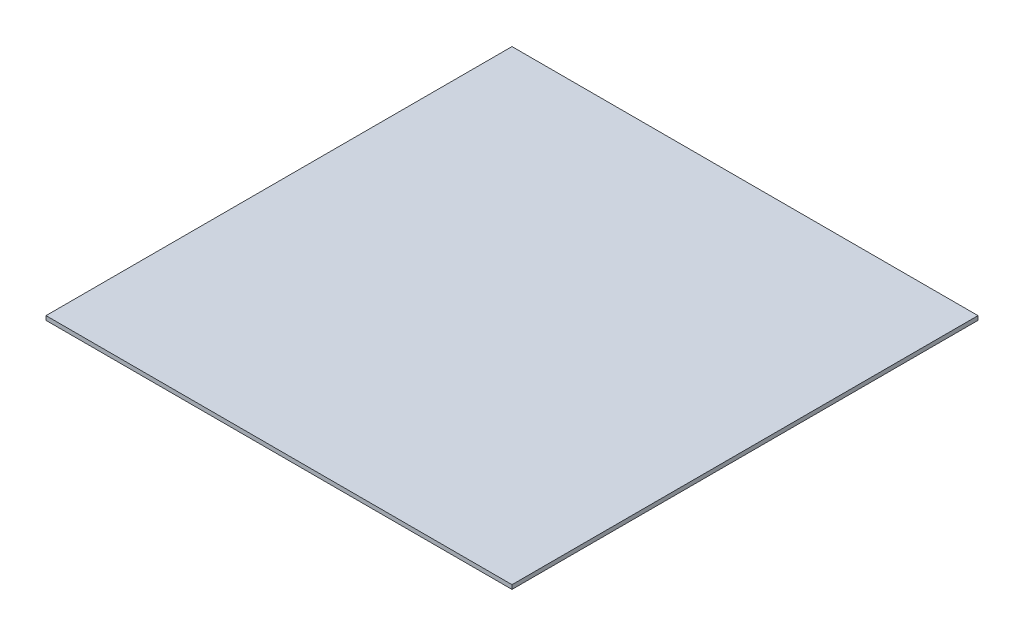
ISO-10303-21;
HEADER;
FILE_DESCRIPTION(('STEP AP214'),'2;1');
FILE_NAME('part.step','',(''),(''),'','','');
FILE_SCHEMA(('AUTOMOTIVE_DESIGN { 1 0 10303 214 1 1 1 1 }'));
ENDSEC;
DATA;
#1=APPLICATION_CONTEXT('core data for automotive mechanical design processes');
#2=APPLICATION_PROTOCOL_DEFINITION('international standard','automotive_design',2000,#1);
#3=PRODUCT_CONTEXT('',#1,'mechanical');
#4=PRODUCT('Part','Part','',(#3));
#5=PRODUCT_RELATED_PRODUCT_CATEGORY('part','',(#4));
#6=PRODUCT_DEFINITION_FORMATION('','',#4);
#7=PRODUCT_DEFINITION_CONTEXT('part definition',#1,'design');
#8=PRODUCT_DEFINITION('design','',#6,#7);
#9=PRODUCT_DEFINITION_SHAPE('','',#8);
#10=(LENGTH_UNIT() NAMED_UNIT(*) SI_UNIT(.MILLI.,.METRE.));
#11=(NAMED_UNIT(*) PLANE_ANGLE_UNIT() SI_UNIT($,.RADIAN.));
#12=(NAMED_UNIT(*) SI_UNIT($,.STERADIAN.) SOLID_ANGLE_UNIT());
#13=UNCERTAINTY_MEASURE_WITH_UNIT(LENGTH_MEASURE(1.E-05),#10,'distance_accuracy_value','');
#14=(GEOMETRIC_REPRESENTATION_CONTEXT(3) GLOBAL_UNCERTAINTY_ASSIGNED_CONTEXT((#13)) GLOBAL_UNIT_ASSIGNED_CONTEXT((#10,
#11,#12)) REPRESENTATION_CONTEXT('',''));
#15=CARTESIAN_POINT('',(0.,0.,0.));
#16=DIRECTION('',(0.,0.,1.));
#17=DIRECTION('',(1.,0.,0.));
#18=AXIS2_PLACEMENT_3D('',#15,#16,#17);
#19=CARTESIAN_POINT('',(112.5,2.,112.5));
#20=DIRECTION('',(-1.,0.,0.));
#21=DIRECTION('',(0.,0.,1.));
#22=AXIS2_PLACEMENT_3D('',#19,#20,#21);
#23=PLANE('',#22);
#24=DIRECTION('',(0.,0.,-1.));
#25=VECTOR('',#24,1.);
#26=CARTESIAN_POINT('',(112.5,0.,112.5));
#27=LINE('',#26,#25);
#28=CARTESIAN_POINT('',(112.5,0.,112.5));
#29=VERTEX_POINT('',#28);
#30=CARTESIAN_POINT('',(112.5,0.,-112.5));
#31=VERTEX_POINT('',#30);
#32=EDGE_CURVE('E100',#29,#31,#27,.T.);
#33=ORIENTED_EDGE('',*,*,#32,.T.);
#34=DIRECTION('',(0.,-1.,0.));
#35=VECTOR('',#34,1.);
#36=CARTESIAN_POINT('',(112.5,2.,-112.5));
#37=LINE('',#36,#35);
#38=CARTESIAN_POINT('',(112.5,2.,-112.5));
#39=VERTEX_POINT('',#38);
#40=EDGE_CURVE('E11',#39,#31,#37,.T.);
#41=ORIENTED_EDGE('',*,*,#40,.F.);
#42=DIRECTION('',(0.,0.,-1.));
#43=VECTOR('',#42,1.);
#44=CARTESIAN_POINT('',(112.5,2.,112.5));
#45=LINE('',#44,#43);
#46=CARTESIAN_POINT('',(112.5,2.,112.5));
#47=VERTEX_POINT('',#46);
#48=EDGE_CURVE('E88',#47,#39,#45,.T.);
#49=ORIENTED_EDGE('',*,*,#48,.F.);
#50=DIRECTION('',(0.,-1.,0.));
#51=VECTOR('',#50,1.);
#52=CARTESIAN_POINT('',(112.5,2.,112.5));
#53=LINE('',#52,#51);
#54=EDGE_CURVE('E96',#47,#29,#53,.T.);
#55=ORIENTED_EDGE('',*,*,#54,.T.);
#56=EDGE_LOOP('',(#33,#41,#49,#55));
#57=FACE_BOUND('',#56,.T.);
#58=ADVANCED_FACE('F37',(#57),#23,.F.);
#59=CARTESIAN_POINT('',(-112.5,2.,-112.5));
#60=DIRECTION('',(0.,0.,1.));
#61=DIRECTION('',(1.,0.,0.));
#62=AXIS2_PLACEMENT_3D('',#59,#60,#61);
#63=PLANE('',#62);
#64=DIRECTION('',(-1.,0.,0.));
#65=VECTOR('',#64,1.);
#66=CARTESIAN_POINT('',(-112.5,0.,-112.5));
#67=LINE('',#66,#65);
#68=CARTESIAN_POINT('',(-112.5,0.,-112.5));
#69=VERTEX_POINT('',#68);
#70=EDGE_CURVE('E92',#31,#69,#67,.T.);
#71=ORIENTED_EDGE('',*,*,#70,.T.);
#72=DIRECTION('',(0.,-1.,0.));
#73=VECTOR('',#72,1.);
#74=CARTESIAN_POINT('',(-112.5,2.,-112.5));
#75=LINE('',#74,#73);
#76=CARTESIAN_POINT('',(-112.5,2.,-112.5));
#77=VERTEX_POINT('',#76);
#78=EDGE_CURVE('E45',#77,#69,#75,.T.);
#79=ORIENTED_EDGE('',*,*,#78,.F.);
#80=DIRECTION('',(-1.,0.,0.));
#81=VECTOR('',#80,1.);
#82=CARTESIAN_POINT('',(-112.5,2.,-112.5));
#83=LINE('',#82,#81);
#84=EDGE_CURVE('E83',#39,#77,#83,.T.);
#85=ORIENTED_EDGE('',*,*,#84,.F.);
#86=ORIENTED_EDGE('',*,*,#40,.T.);
#87=EDGE_LOOP('',(#71,#79,#85,#86));
#88=FACE_BOUND('',#87,.T.);
#89=ADVANCED_FACE('F91',(#88),#63,.F.);
#90=CARTESIAN_POINT('',(-112.5,2.,112.5));
#91=DIRECTION('',(1.,0.,0.));
#92=DIRECTION('',(0.,0.,-1.));
#93=AXIS2_PLACEMENT_3D('',#90,#91,#92);
#94=PLANE('',#93);
#95=DIRECTION('',(0.,0.,1.));
#96=VECTOR('',#95,1.);
#97=CARTESIAN_POINT('',(-112.5,0.,112.5));
#98=LINE('',#97,#96);
#99=CARTESIAN_POINT('',(-112.5,0.,112.5));
#100=VERTEX_POINT('',#99);
#101=EDGE_CURVE('E70',#69,#100,#98,.T.);
#102=ORIENTED_EDGE('',*,*,#101,.T.);
#103=DIRECTION('',(0.,-1.,0.));
#104=VECTOR('',#103,1.);
#105=CARTESIAN_POINT('',(-112.5,2.,112.5));
#106=LINE('',#105,#104);
#107=CARTESIAN_POINT('',(-112.5,2.,112.5));
#108=VERTEX_POINT('',#107);
#109=EDGE_CURVE('E93',#108,#100,#106,.T.);
#110=ORIENTED_EDGE('',*,*,#109,.F.);
#111=DIRECTION('',(0.,0.,1.));
#112=VECTOR('',#111,1.);
#113=CARTESIAN_POINT('',(-112.5,2.,112.5));
#114=LINE('',#113,#112);
#115=EDGE_CURVE('E86',#77,#108,#114,.T.);
#116=ORIENTED_EDGE('',*,*,#115,.F.);
#117=ORIENTED_EDGE('',*,*,#78,.T.);
#118=EDGE_LOOP('',(#102,#110,#116,#117));
#119=FACE_BOUND('',#118,.T.);
#120=ADVANCED_FACE('F94',(#119),#94,.F.);
#121=CARTESIAN_POINT('',(-112.5,2.,112.5));
#122=DIRECTION('',(0.,0.,-1.));
#123=DIRECTION('',(-1.,0.,0.));
#124=AXIS2_PLACEMENT_3D('',#121,#122,#123);
#125=PLANE('',#124);
#126=DIRECTION('',(1.,0.,0.));
#127=VECTOR('',#126,1.);
#128=CARTESIAN_POINT('',(-112.5,0.,112.5));
#129=LINE('',#128,#127);
#130=EDGE_CURVE('E76',#100,#29,#129,.T.);
#131=ORIENTED_EDGE('',*,*,#130,.T.);
#132=ORIENTED_EDGE('',*,*,#54,.F.);
#133=DIRECTION('',(1.,0.,0.));
#134=VECTOR('',#133,1.);
#135=CARTESIAN_POINT('',(-112.5,2.,112.5));
#136=LINE('',#135,#134);
#137=EDGE_CURVE('E53',#108,#47,#136,.T.);
#138=ORIENTED_EDGE('',*,*,#137,.F.);
#139=ORIENTED_EDGE('',*,*,#109,.T.);
#140=EDGE_LOOP('',(#131,#132,#138,#139));
#141=FACE_BOUND('',#140,.T.);
#142=ADVANCED_FACE('F107',(#141),#125,.F.);
#143=CARTESIAN_POINT('',(0.,2.,0.));
#144=DIRECTION('',(0.,-1.,0.));
#145=DIRECTION('',(0.,0.,-1.));
#146=AXIS2_PLACEMENT_3D('',#143,#144,#145);
#147=PLANE('',#146);
#148=ORIENTED_EDGE('',*,*,#48,.T.);
#149=ORIENTED_EDGE('',*,*,#84,.T.);
#150=ORIENTED_EDGE('',*,*,#115,.T.);
#151=ORIENTED_EDGE('',*,*,#137,.T.);
#152=EDGE_LOOP('',(#148,#149,#150,#151));
#153=FACE_BOUND('',#152,.T.);
#154=ADVANCED_FACE('F84',(#153),#147,.F.);
#155=CARTESIAN_POINT('',(0.,0.,0.));
#156=DIRECTION('',(0.,-1.,0.));
#157=DIRECTION('',(0.,0.,-1.));
#158=AXIS2_PLACEMENT_3D('',#155,#156,#157);
#159=PLANE('',#158);
#160=ORIENTED_EDGE('',*,*,#32,.F.);
#161=ORIENTED_EDGE('',*,*,#130,.F.);
#162=ORIENTED_EDGE('',*,*,#101,.F.);
#163=ORIENTED_EDGE('',*,*,#70,.F.);
#164=EDGE_LOOP('',(#160,#161,#162,#163));
#165=FACE_BOUND('',#164,.T.);
#166=ADVANCED_FACE('F110',(#165),#159,.T.);
#167=CLOSED_SHELL('',(#58,#89,#120,#142,#154,#166));
#168=MANIFOLD_SOLID_BREP('B2',#167);
#169=ADVANCED_BREP_SHAPE_REPRESENTATION('',(#18,#168),#14);
#170=SHAPE_DEFINITION_REPRESENTATION(#9,#169);
ENDSEC;
END-ISO-10303-21;
